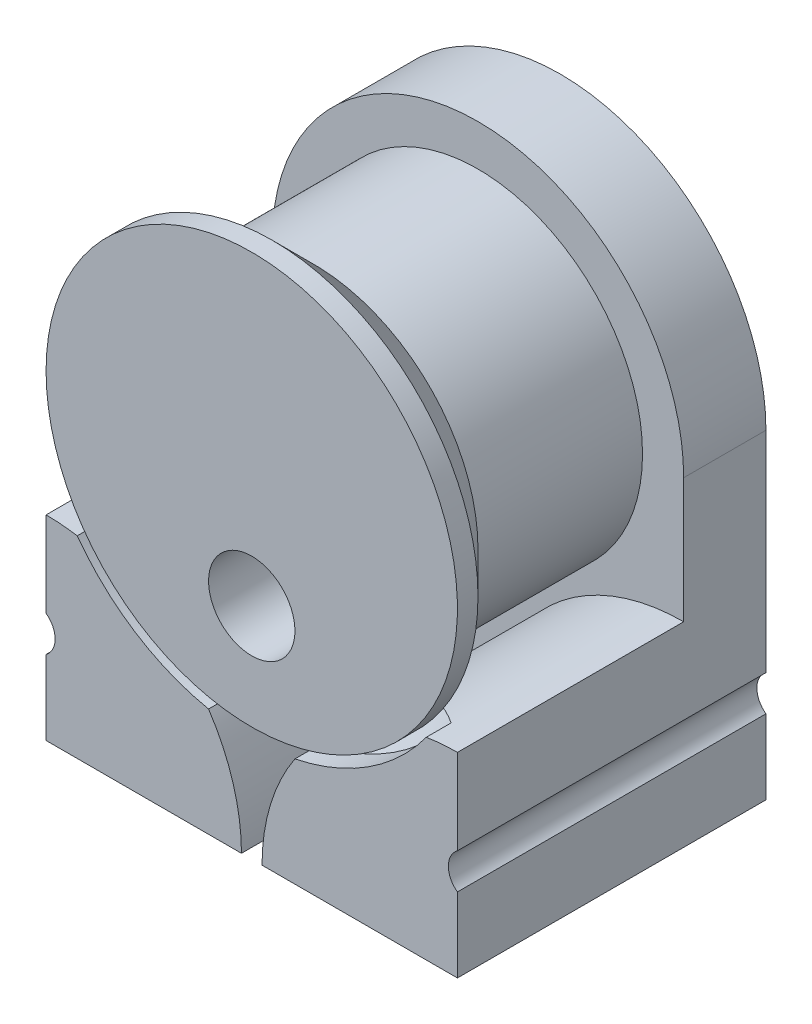
ISO-10303-21;
HEADER;
FILE_DESCRIPTION(('STEP AP214'),'2;1');
FILE_NAME('part.step','',(''),(''),'','','');
FILE_SCHEMA(('AUTOMOTIVE_DESIGN { 1 0 10303 214 1 1 1 1 }'));
ENDSEC;
DATA;
#1=APPLICATION_CONTEXT('core data for automotive mechanical design processes');
#2=APPLICATION_PROTOCOL_DEFINITION('international standard','automotive_design',2000,#1);
#3=PRODUCT_CONTEXT('',#1,'mechanical');
#4=PRODUCT('Part','Part','',(#3));
#5=PRODUCT_RELATED_PRODUCT_CATEGORY('part','',(#4));
#6=PRODUCT_DEFINITION_FORMATION('','',#4);
#7=PRODUCT_DEFINITION_CONTEXT('part definition',#1,'design');
#8=PRODUCT_DEFINITION('design','',#6,#7);
#9=PRODUCT_DEFINITION_SHAPE('','',#8);
#10=(LENGTH_UNIT() NAMED_UNIT(*) SI_UNIT(.MILLI.,.METRE.));
#11=(NAMED_UNIT(*) PLANE_ANGLE_UNIT() SI_UNIT($,.RADIAN.));
#12=(NAMED_UNIT(*) SI_UNIT($,.STERADIAN.) SOLID_ANGLE_UNIT());
#13=UNCERTAINTY_MEASURE_WITH_UNIT(LENGTH_MEASURE(1.E-05),#10,'distance_accuracy_value','');
#14=(GEOMETRIC_REPRESENTATION_CONTEXT(3) GLOBAL_UNCERTAINTY_ASSIGNED_CONTEXT((#13)) GLOBAL_UNIT_ASSIGNED_CONTEXT((#10,
#11,#12)) REPRESENTATION_CONTEXT('',''));
#15=CARTESIAN_POINT('',(0.,0.,0.));
#16=DIRECTION('',(0.,0.,1.));
#17=DIRECTION('',(1.,0.,0.));
#18=AXIS2_PLACEMENT_3D('',#15,#16,#17);
#19=CARTESIAN_POINT('',(-2.85327317332453E-13,435.100000000001,344.000000000001));
#20=DIRECTION('',(0.,0.,-1.));
#21=DIRECTION('',(-1.,0.,0.));
#22=AXIS2_PLACEMENT_3D('',#19,#20,#21);
#23=CYLINDRICAL_SURFACE('',#22,2.10000000000003);
#24=CARTESIAN_POINT('',(-2.85327317332453E-13,435.100000000001,327.950000000001));
#25=DIRECTION('',(0.,0.,-1.));
#26=DIRECTION('',(-1.,0.,0.));
#27=AXIS2_PLACEMENT_3D('',#24,#25,#26);
#28=CIRCLE('',#27,2.10000000000003);
#29=CARTESIAN_POINT('',(-2.10000000000031,435.100000000001,327.950000000001));
#30=VERTEX_POINT('',#29);
#31=EDGE_CURVE('E19',#30,#30,#28,.F.);
#32=ORIENTED_EDGE('',*,*,#31,.F.);
#33=EDGE_LOOP('',(#32));
#34=FACE_BOUND('',#33,.T.);
#35=CARTESIAN_POINT('',(-2.85327317332453E-13,435.100000000001,344.000000000001));
#36=DIRECTION('',(0.,0.,-1.));
#37=DIRECTION('',(-1.,0.,0.));
#38=AXIS2_PLACEMENT_3D('',#35,#36,#37);
#39=CIRCLE('',#38,2.10000000000003);
#40=CARTESIAN_POINT('',(-2.10000000000031,435.100000000001,344.000000000001));
#41=VERTEX_POINT('',#40);
#42=EDGE_CURVE('E407',#41,#41,#39,.T.);
#43=ORIENTED_EDGE('',*,*,#42,.F.);
#44=EDGE_LOOP('',(#43));
#45=FACE_BOUND('',#44,.T.);
#46=ADVANCED_FACE('F16',(#34,#45),#23,.F.);
#47=CARTESIAN_POINT('',(-2.85327317332453E-13,440.000000000001,344.000000000001));
#48=DIRECTION('',(0.,0.,-1.));
#49=DIRECTION('',(-1.,0.,0.));
#50=AXIS2_PLACEMENT_3D('',#47,#48,#49);
#51=CYLINDRICAL_SURFACE('',#50,10.5);
#52=CARTESIAN_POINT('',(-2.85327317332453E-13,440.000000000001,344.000000000001));
#53=DIRECTION('',(0.,0.,-1.));
#54=DIRECTION('',(-1.,0.,0.));
#55=AXIS2_PLACEMENT_3D('',#52,#53,#54);
#56=CIRCLE('',#55,10.5);
#57=CARTESIAN_POINT('',(8.48424199356027,433.81391579473,344.000000000001));
#58=VERTEX_POINT('',#57);
#59=CARTESIAN_POINT('',(2.10012615747792,429.712168832905,344.000000000001));
#60=VERTEX_POINT('',#59);
#61=EDGE_CURVE('E393',#58,#60,#56,.T.);
#62=ORIENTED_EDGE('',*,*,#61,.F.);
#63=DIRECTION('',(0.,0.,-1.));
#64=VECTOR('',#63,1.);
#65=CARTESIAN_POINT('',(8.48424199356025,433.81391579473,344.000000000001));
#66=LINE('',#65,#64);
#67=CARTESIAN_POINT('',(8.48424199356004,433.81391579473,342.792893218815));
#68=VERTEX_POINT('',#67);
#69=EDGE_CURVE('E448',#68,#58,#66,.F.);
#70=ORIENTED_EDGE('',*,*,#69,.F.);
#71=CARTESIAN_POINT('',(-2.85327317332453E-13,440.000000000001,342.792893218814));
#72=DIRECTION('',(0.,0.,1.));
#73=DIRECTION('',(-1.,0.,0.));
#74=AXIS2_PLACEMENT_3D('',#71,#72,#73);
#75=CIRCLE('',#74,10.4999999999997);
#76=CARTESIAN_POINT('',(2.10012615747805,429.712168832905,342.792893218815));
#77=VERTEX_POINT('',#76);
#78=EDGE_CURVE('E404',#68,#77,#75,.F.);
#79=ORIENTED_EDGE('',*,*,#78,.T.);
#80=DIRECTION('',(0.,0.,-1.));
#81=VECTOR('',#80,1.);
#82=CARTESIAN_POINT('',(2.10012615747795,429.712168832905,344.000000000001));
#83=LINE('',#82,#81);
#84=EDGE_CURVE('E163',#60,#77,#83,.T.);
#85=ORIENTED_EDGE('',*,*,#84,.F.);
#86=EDGE_LOOP('',(#62,#70,#79,#85));
#87=FACE_BOUND('',#86,.T.);
#88=ADVANCED_FACE('F298',(#87),#51,.F.);
#89=CARTESIAN_POINT('',(-2.73644660940691,424.435617565764,327.950000000001));
#90=DIRECTION('',(-0.707106781186555,0.,-0.70710678118654));
#91=DIRECTION('',(-0.70710678118654,0.,0.707106781186555));
#92=AXIS2_PLACEMENT_3D('',#89,#90,#91);
#93=PLANE('',#92);
#94=DIRECTION('',(-0.707106781186576,0.,0.707106781186519));
#95=VECTOR('',#94,1.);
#96=CARTESIAN_POINT('',(-2.73644660940691,439.999617565764,327.950000000001));
#97=LINE('',#96,#95);
#98=CARTESIAN_POINT('',(-2.73644660940691,439.999617565764,327.950000000001));
#99=VERTEX_POINT('',#98);
#100=CARTESIAN_POINT('',(-3.78644660940699,439.999617565764,329.000000000001));
#101=VERTEX_POINT('',#100);
#102=EDGE_CURVE('E162',#99,#101,#97,.T.);
#103=ORIENTED_EDGE('',*,*,#102,.F.);
#104=DIRECTION('',(0.,1.,0.));
#105=VECTOR('',#104,1.);
#106=CARTESIAN_POINT('',(-2.73644660940691,424.435617565764,327.950000000001));
#107=LINE('',#106,#105);
#108=CARTESIAN_POINT('',(-2.73644660940691,424.435617565759,327.950000000001));
#109=VERTEX_POINT('',#108);
#110=EDGE_CURVE('E166',#109,#99,#107,.T.);
#111=ORIENTED_EDGE('',*,*,#110,.F.);
#112=DIRECTION('',(-0.70710678118654,0.,0.707106781186555));
#113=VECTOR('',#112,1.);
#114=CARTESIAN_POINT('',(-2.73644660940691,424.435617565764,327.950000000001));
#115=LINE('',#114,#113);
#116=CARTESIAN_POINT('',(-3.78644660940697,424.435617565746,329.000000000001));
#117=VERTEX_POINT('',#116);
#118=EDGE_CURVE('E152',#109,#117,#115,.T.);
#119=ORIENTED_EDGE('',*,*,#118,.T.);
#120=DIRECTION('',(0.,-1.,0.));
#121=VECTOR('',#120,1.);
#122=CARTESIAN_POINT('',(-3.78644660940699,437.217808782779,329.000000000001));
#123=LINE('',#122,#121);
#124=EDGE_CURVE('E378',#117,#101,#123,.F.);
#125=ORIENTED_EDGE('',*,*,#124,.T.);
#126=EDGE_LOOP('',(#103,#111,#119,#125));
#127=FACE_BOUND('',#126,.T.);
#128=ADVANCED_FACE('F167',(#127),#93,.T.);
#129=CARTESIAN_POINT('',(-1.34336985979644E-13,439.999617565764,328.475000000001));
#130=DIRECTION('',(0.,1.,0.));
#131=DIRECTION('',(0.,0.,1.));
#132=AXIS2_PLACEMENT_3D('',#129,#130,#131);
#133=PLANE('',#132);
#134=DIRECTION('',(1.,0.,0.));
#135=VECTOR('',#134,1.);
#136=CARTESIAN_POINT('',(-2.79776202122451E-13,439.999617565764,329.000000000001));
#137=LINE('',#136,#135);
#138=CARTESIAN_POINT('',(3.78644660940672,439.999617565764,329.000000000001));
#139=VERTEX_POINT('',#138);
#140=EDGE_CURVE('E416',#101,#139,#137,.T.);
#141=ORIENTED_EDGE('',*,*,#140,.T.);
#142=DIRECTION('',(-0.707106781186542,0.,-0.707106781186553));
#143=VECTOR('',#142,1.);
#144=CARTESIAN_POINT('',(3.78644660940673,439.999617565764,329.000000000001));
#145=LINE('',#144,#143);
#146=CARTESIAN_POINT('',(2.73644660940664,439.999617565764,327.950000000001));
#147=VERTEX_POINT('',#146);
#148=EDGE_CURVE('E129',#147,#139,#145,.F.);
#149=ORIENTED_EDGE('',*,*,#148,.F.);
#150=DIRECTION('',(-1.,0.,0.));
#151=VECTOR('',#150,1.);
#152=CARTESIAN_POINT('',(2.73644660940656,439.999617565764,327.950000000001));
#153=LINE('',#152,#151);
#154=EDGE_CURVE('E171',#99,#147,#153,.F.);
#155=ORIENTED_EDGE('',*,*,#154,.F.);
#156=ORIENTED_EDGE('',*,*,#102,.T.);
#157=EDGE_LOOP('',(#141,#149,#155,#156));
#158=FACE_BOUND('',#157,.T.);
#159=ADVANCED_FACE('F293',(#158),#133,.T.);
#160=CARTESIAN_POINT('',(3.78644660940673,424.435617565764,329.000000000001));
#161=DIRECTION('',(0.707106781186553,0.,-0.707106781186542));
#162=DIRECTION('',(-0.707106781186542,0.,-0.707106781186553));
#163=AXIS2_PLACEMENT_3D('',#160,#161,#162);
#164=PLANE('',#163);
#165=ORIENTED_EDGE('',*,*,#148,.T.);
#166=DIRECTION('',(0.,-1.,0.));
#167=VECTOR('',#166,1.);
#168=CARTESIAN_POINT('',(3.78644660940672,437.217808782779,329.000000000001));
#169=LINE('',#168,#167);
#170=CARTESIAN_POINT('',(3.78644660940673,424.435617565779,329.000000000001));
#171=VERTEX_POINT('',#170);
#172=EDGE_CURVE('E372',#139,#171,#169,.T.);
#173=ORIENTED_EDGE('',*,*,#172,.T.);
#174=DIRECTION('',(-0.707106781186542,0.,-0.707106781186553));
#175=VECTOR('',#174,1.);
#176=CARTESIAN_POINT('',(3.78644660940673,424.435617565764,329.000000000001));
#177=LINE('',#176,#175);
#178=CARTESIAN_POINT('',(2.7364466094066,424.435617565766,327.950000000001));
#179=VERTEX_POINT('',#178);
#180=EDGE_CURVE('E428',#171,#179,#177,.T.);
#181=ORIENTED_EDGE('',*,*,#180,.T.);
#182=DIRECTION('',(0.,1.,0.));
#183=VECTOR('',#182,1.);
#184=CARTESIAN_POINT('',(2.73644660940656,424.435617565764,327.950000000001));
#185=LINE('',#184,#183);
#186=EDGE_CURVE('E176',#147,#179,#185,.F.);
#187=ORIENTED_EDGE('',*,*,#186,.F.);
#188=EDGE_LOOP('',(#165,#173,#181,#187));
#189=FACE_BOUND('',#188,.T.);
#190=ADVANCED_FACE('F289',(#189),#164,.T.);
#191=CARTESIAN_POINT('',(-2.85327317332453E-13,440.000000000001,344.000000000001));
#192=DIRECTION('',(0.,0.,-1.));
#193=DIRECTION('',(-1.,0.,0.));
#194=AXIS2_PLACEMENT_3D('',#191,#192,#193);
#195=CYLINDRICAL_SURFACE('',#194,10.5);
#196=CARTESIAN_POINT('',(-2.85327317332453E-13,440.000000000001,344.000000000001));
#197=DIRECTION('',(0.,0.,-1.));
#198=DIRECTION('',(-1.,0.,0.));
#199=AXIS2_PLACEMENT_3D('',#196,#197,#198);
#200=CIRCLE('',#199,10.5);
#201=CARTESIAN_POINT('',(-2.10012615450036,429.712168832297,344.000000000001));
#202=VERTEX_POINT('',#201);
#203=CARTESIAN_POINT('',(-8.48424199520149,433.81391579698,344.000000000001));
#204=VERTEX_POINT('',#203);
#205=EDGE_CURVE('E362',#202,#204,#200,.T.);
#206=ORIENTED_EDGE('',*,*,#205,.F.);
#207=DIRECTION('',(0.,0.,-1.));
#208=VECTOR('',#207,1.);
#209=CARTESIAN_POINT('',(-2.10012615450045,429.712168832297,344.000000000001));
#210=LINE('',#209,#208);
#211=CARTESIAN_POINT('',(-2.10012615450051,429.712168832297,342.792893218815));
#212=VERTEX_POINT('',#211);
#213=EDGE_CURVE('E422',#212,#202,#210,.F.);
#214=ORIENTED_EDGE('',*,*,#213,.F.);
#215=CARTESIAN_POINT('',(-2.85327317332453E-13,440.000000000001,342.792893218814));
#216=DIRECTION('',(0.,0.,1.));
#217=DIRECTION('',(-1.,0.,0.));
#218=AXIS2_PLACEMENT_3D('',#215,#216,#217);
#219=CIRCLE('',#218,10.4999999999996);
#220=CARTESIAN_POINT('',(-8.48424199520122,433.81391579698,342.792893218815));
#221=VERTEX_POINT('',#220);
#222=EDGE_CURVE('E366',#212,#221,#219,.F.);
#223=ORIENTED_EDGE('',*,*,#222,.T.);
#224=DIRECTION('',(0.,0.,-1.));
#225=VECTOR('',#224,1.);
#226=CARTESIAN_POINT('',(-8.48424199520137,433.81391579698,344.000000000001));
#227=LINE('',#226,#225);
#228=EDGE_CURVE('E172',#204,#221,#227,.T.);
#229=ORIENTED_EDGE('',*,*,#228,.F.);
#230=EDGE_LOOP('',(#206,#214,#223,#229));
#231=FACE_BOUND('',#230,.T.);
#232=ADVANCED_FACE('F285',(#231),#195,.F.);
#233=CARTESIAN_POINT('',(-10.0000000000003,440.000000000001,329.000000000001));
#234=DIRECTION('',(-1.,0.,0.));
#235=DIRECTION('',(0.,-1.,0.));
#236=AXIS2_PLACEMENT_3D('',#233,#234,#235);
#237=PLANE('',#236);
#238=DIRECTION('',(0.,0.,1.));
#239=VECTOR('',#238,1.);
#240=CARTESIAN_POINT('',(-10.0000000000003,424.435617565712,329.000000000001));
#241=LINE('',#240,#239);
#242=CARTESIAN_POINT('',(-10.0000000000003,424.435617565712,344.000000000001));
#243=VERTEX_POINT('',#242);
#244=CARTESIAN_POINT('',(-10.0000000000003,424.435617565712,329.000000000001));
#245=VERTEX_POINT('',#244);
#246=EDGE_CURVE('E182',#243,#245,#241,.F.);
#247=ORIENTED_EDGE('',*,*,#246,.F.);
#248=DIRECTION('',(0.,-1.,0.));
#249=VECTOR('',#248,1.);
#250=CARTESIAN_POINT('',(-10.0000000000003,429.185617566863,344.000000000001));
#251=LINE('',#250,#249);
#252=CARTESIAN_POINT('',(-10.0000000000005,428.06020241429,344.000000000001));
#253=VERTEX_POINT('',#252);
#254=EDGE_CURVE('E359',#253,#243,#251,.T.);
#255=ORIENTED_EDGE('',*,*,#254,.F.);
#256=DIRECTION('',(0.,0.,-1.));
#257=VECTOR('',#256,1.);
#258=CARTESIAN_POINT('',(-10.0000000000007,428.06020241429,344.000000000001));
#259=LINE('',#258,#257);
#260=CARTESIAN_POINT('',(-10.0000000000005,428.06020241429,329.000000000001));
#261=VERTEX_POINT('',#260);
#262=EDGE_CURVE('E392',#253,#261,#259,.T.);
#263=ORIENTED_EDGE('',*,*,#262,.T.);
#264=DIRECTION('',(0.,-1.,0.));
#265=VECTOR('',#264,1.);
#266=CARTESIAN_POINT('',(-10.0000000000003,437.217808782779,329.000000000001));
#267=LINE('',#266,#265);
#268=EDGE_CURVE('E375',#261,#245,#267,.T.);
#269=ORIENTED_EDGE('',*,*,#268,.T.);
#270=EDGE_LOOP('',(#247,#255,#263,#269));
#271=FACE_BOUND('',#270,.T.);
#272=ADVANCED_FACE('F281',(#271),#237,.T.);
#273=CARTESIAN_POINT('',(2.73644660940656,424.435617565764,327.950000000001));
#274=DIRECTION('',(0.,0.,-1.));
#275=DIRECTION('',(-1.,0.,0.));
#276=AXIS2_PLACEMENT_3D('',#273,#274,#275);
#277=PLANE('',#276);
#278=ORIENTED_EDGE('',*,*,#31,.T.);
#279=EDGE_LOOP('',(#278));
#280=FACE_BOUND('',#279,.T.);
#281=ORIENTED_EDGE('',*,*,#154,.T.);
#282=ORIENTED_EDGE('',*,*,#186,.T.);
#283=DIRECTION('',(1.,5.43565192856476E-12,0.));
#284=VECTOR('',#283,1.);
#285=CARTESIAN_POINT('',(-10.0000000000003,424.435617565712,327.950000000001));
#286=LINE('',#285,#284);
#287=EDGE_CURVE('E156',#109,#179,#286,.T.);
#288=ORIENTED_EDGE('',*,*,#287,.F.);
#289=ORIENTED_EDGE('',*,*,#110,.T.);
#290=EDGE_LOOP('',(#281,#282,#288,#289));
#291=FACE_BOUND('',#290,.T.);
#292=ADVANCED_FACE('F175',(#280,#291),#277,.T.);
#293=CARTESIAN_POINT('',(9.99999999999972,424.435617565556,329.000000000001));
#294=DIRECTION('',(1.,0.,0.));
#295=DIRECTION('',(0.,1.,0.));
#296=AXIS2_PLACEMENT_3D('',#293,#294,#295);
#297=PLANE('',#296);
#298=DIRECTION('',(0.,0.,1.));
#299=VECTOR('',#298,1.);
#300=CARTESIAN_POINT('',(9.99999999999972,424.435617565821,329.000000000001));
#301=LINE('',#300,#299);
#302=CARTESIAN_POINT('',(9.99999999999972,424.435617565802,329.000000000001));
#303=VERTEX_POINT('',#302);
#304=CARTESIAN_POINT('',(9.99999999999972,424.435617565737,344.000000000001));
#305=VERTEX_POINT('',#304);
#306=EDGE_CURVE('E180',#303,#305,#301,.T.);
#307=ORIENTED_EDGE('',*,*,#306,.F.);
#308=DIRECTION('',(0.,-1.,0.));
#309=VECTOR('',#308,1.);
#310=CARTESIAN_POINT('',(9.99999999999972,437.217808782779,329.000000000001));
#311=LINE('',#310,#309);
#312=CARTESIAN_POINT('',(9.99999999999991,428.06020241429,329.000000000001));
#313=VERTEX_POINT('',#312);
#314=EDGE_CURVE('E370',#303,#313,#311,.F.);
#315=ORIENTED_EDGE('',*,*,#314,.T.);
#316=DIRECTION('',(0.,0.,-1.));
#317=VECTOR('',#316,1.);
#318=CARTESIAN_POINT('',(10.0000000000001,428.06020241429,344.000000000001));
#319=LINE('',#318,#317);
#320=CARTESIAN_POINT('',(9.99999999999991,428.06020241429,344.000000000001));
#321=VERTEX_POINT('',#320);
#322=EDGE_CURVE('E120',#313,#321,#319,.F.);
#323=ORIENTED_EDGE('',*,*,#322,.T.);
#324=DIRECTION('',(0.,-1.,0.));
#325=VECTOR('',#324,1.);
#326=CARTESIAN_POINT('',(9.99999999999972,429.185617565807,344.000000000001));
#327=LINE('',#326,#325);
#328=EDGE_CURVE('E389',#305,#321,#327,.F.);
#329=ORIENTED_EDGE('',*,*,#328,.F.);
#330=EDGE_LOOP('',(#307,#315,#323,#329));
#331=FACE_BOUND('',#330,.T.);
#332=ADVANCED_FACE('F275',(#331),#297,.T.);
#333=CARTESIAN_POINT('',(-2.84772205816353E-13,440.000000000001,344.000000000001));
#334=DIRECTION('',(0.,0.,1.));
#335=DIRECTION('',(1.,0.,0.));
#336=AXIS2_PLACEMENT_3D('',#333,#334,#335);
#337=PLANE('',#336);
#338=ORIENTED_EDGE('',*,*,#42,.T.);
#339=EDGE_LOOP('',(#338));
#340=FACE_BOUND('',#339,.T.);
#341=CARTESIAN_POINT('',(-2.85327317332453E-13,440.000000000001,344.000000000001));
#342=DIRECTION('',(0.,0.,-1.));
#343=DIRECTION('',(-1.,0.,0.));
#344=AXIS2_PLACEMENT_3D('',#341,#342,#343);
#345=CIRCLE('',#344,10.);
#346=CARTESIAN_POINT('',(-10.0000000000003,440.000000000001,344.000000000001));
#347=VERTEX_POINT('',#346);
#348=EDGE_CURVE('E262',#347,#347,#345,.T.);
#349=ORIENTED_EDGE('',*,*,#348,.F.);
#350=EDGE_LOOP('',(#349));
#351=FACE_BOUND('',#350,.T.);
#352=ADVANCED_FACE('F270',(#340,#351),#337,.T.);
#353=CARTESIAN_POINT('',(-2.85362011798185E-13,440.000000000001,342.792893218814));
#354=DIRECTION('',(0.,0.,1.));
#355=DIRECTION('',(1.,0.,0.));
#356=AXIS2_PLACEMENT_3D('',#353,#354,#355);
#357=CONICAL_SURFACE('',#356,10.4999999999997,0.785398163397438);
#358=ORIENTED_EDGE('',*,*,#78,.F.);
#359=CARTESIAN_POINT('',(2.10012615747811,429.712168832905,342.792893218814));
#360=CARTESIAN_POINT('',(2.18479779041489,429.838895311102,342.68571191633));
#361=CARTESIAN_POINT('',(2.27361513965295,429.96530333963,342.581252486632));
#362=CARTESIAN_POINT('',(2.46052099960255,430.217580722435,342.379276338492));
#363=CARTESIAN_POINT('',(2.55863556737761,430.343447463415,342.281780561438));
#364=CARTESIAN_POINT('',(2.76638243779769,430.596130933452,342.094293554601));
#365=CARTESIAN_POINT('',(2.87618195283214,430.722927531902,342.004457769162));
#366=CARTESIAN_POINT('',(3.10638952233652,430.974518945584,341.836837672188));
#367=CARTESIAN_POINT('',(3.22678520474039,431.099315899434,341.759039590783));
#368=CARTESIAN_POINT('',(3.52390535415852,431.390275782936,341.593287132563));
#369=CARTESIAN_POINT('',(3.7054163954792,431.5553358036,341.511589245267));
#370=CARTESIAN_POINT('',(3.99183063508738,431.795466810184,341.416192990436));
#371=CARTESIAN_POINT('',(4.08939145255492,431.87407490544,341.388954778059));
#372=CARTESIAN_POINT('',(4.28894266930965,432.028357193194,341.344232987635));
#373=CARTESIAN_POINT('',(4.3909309455882,432.104032759629,341.326744788854));
#374=CARTESIAN_POINT('',(4.5996492544149,432.252442992006,341.302056417024));
#375=CARTESIAN_POINT('',(4.7064137635243,432.325144968501,341.294950478431));
#376=CARTESIAN_POINT('',(4.9229457831797,432.466197468147,341.29160900257));
#377=CARTESIAN_POINT('',(5.03271324676092,432.534548059296,341.295373295393));
#378=CARTESIAN_POINT('',(5.25443485748701,432.666430123141,341.313633243862));
#379=CARTESIAN_POINT('',(5.36639188223167,432.729954631322,341.328144095263));
#380=CARTESIAN_POINT('',(5.59143566313277,432.851729845857,341.367358160429));
#381=CARTESIAN_POINT('',(5.70452298403262,432.909977752801,341.392066746254));
#382=CARTESIAN_POINT('',(5.9520528958104,433.031343042608,341.456296210421));
#383=CARTESIAN_POINT('',(6.08654790129299,433.093345089836,341.497719330097));
#384=CARTESIAN_POINT('',(6.35489685062882,433.20970700446,341.592010724826));
#385=CARTESIAN_POINT('',(6.48875023730398,433.264061098661,341.644887570281));
#386=CARTESIAN_POINT('',(6.75546826527494,433.365535911485,341.760489713619));
#387=CARTESIAN_POINT('',(6.88832837101487,433.412632922974,341.82324598979));
#388=CARTESIAN_POINT('',(7.15219366077263,433.499794585111,341.956831595262));
#389=CARTESIAN_POINT('',(7.28319925713663,433.539860822354,342.027659097209));
#390=CARTESIAN_POINT('',(7.59653510701797,433.628531298045,342.20639655167));
#391=CARTESIAN_POINT('',(7.77790076755833,433.673907198503,342.317609570718));
#392=CARTESIAN_POINT('',(8.04603417999555,433.732944327343,342.491408813547));
#393=CARTESIAN_POINT('',(8.13435163873345,433.751054340627,342.55021143257));
#394=CARTESIAN_POINT('',(8.31001238632952,433.784517179878,342.66999008042));
#395=CARTESIAN_POINT('',(8.39735581639186,433.799870410497,342.730965788693));
#396=CARTESIAN_POINT('',(8.48424199355994,433.81391579473,342.792893218814));
#397=B_SPLINE_CURVE_WITH_KNOTS('',3,(#359,#360,#361,#362,#363,#364,#365,#366,#367,#368,#369,
#370,#371,#372,#373,#374,#375,#376,#377,#378,#379,#380,#381,#382,#383,#384,#385,#386,#387,#388,
#389,#390,#391,#392,#393,#394,#395,#396),.UNSPECIFIED.,.F.,.F.,(4,2,2,2,2,2,2,2,2,2,2,2,2,2,2,2,
2,2,4),(0.,0.559054345413364,1.11972469099276,1.68991040327212,2.25943898268726,
3.03187468724661,3.41612386072894,3.80019077542571,4.18772246694005,4.57524810110329,
4.96332274960025,5.35160209321614,5.81223791210797,6.27321960592904,6.73567666897444,
7.19802923737979,7.84982811752394,8.1726934452781,8.49551134259726),.UNSPECIFIED.);
#398=EDGE_CURVE('E252',#77,#68,#397,.T.);
#399=ORIENTED_EDGE('',*,*,#398,.F.);
#400=EDGE_LOOP('',(#358,#399));
#401=FACE_BOUND('',#400,.T.);
#402=ADVANCED_FACE('F264',(#401),#357,.F.);
#403=CARTESIAN_POINT('',(10.6298158491508,428.925799984371,344.000000000001));
#404=DIRECTION('',(0.,0.,-1.));
#405=DIRECTION('',(-1.,0.,0.));
#406=AXIS2_PLACEMENT_3D('',#403,#404,#405);
#407=CYLINDRICAL_SURFACE('',#406,1.07047987238082);
#408=ORIENTED_EDGE('',*,*,#322,.F.);
#409=CARTESIAN_POINT('',(10.6298158491508,428.925799984371,329.000000000001));
#410=DIRECTION('',(0.,0.,-1.));
#411=DIRECTION('',(-1.,0.,0.));
#412=AXIS2_PLACEMENT_3D('',#409,#410,#411);
#413=CIRCLE('',#412,1.07047987238082);
#414=CARTESIAN_POINT('',(9.99999999999972,429.791397554452,329.000000000001));
#415=VERTEX_POINT('',#414);
#416=EDGE_CURVE('E369',#313,#415,#413,.T.);
#417=ORIENTED_EDGE('',*,*,#416,.T.);
#418=DIRECTION('',(0.,0.,1.));
#419=VECTOR('',#418,1.);
#420=CARTESIAN_POINT('',(9.99999999999972,429.791397554452,329.000000000001));
#421=LINE('',#420,#419);
#422=CARTESIAN_POINT('',(9.99999999999972,429.791397554452,344.000000000001));
#423=VERTEX_POINT('',#422);
#424=EDGE_CURVE('E388',#423,#415,#421,.F.);
#425=ORIENTED_EDGE('',*,*,#424,.F.);
#426=CARTESIAN_POINT('',(10.6298158491508,428.925799984371,344.000000000001));
#427=DIRECTION('',(0.,0.,-1.));
#428=DIRECTION('',(-1.,0.,0.));
#429=AXIS2_PLACEMENT_3D('',#426,#427,#428);
#430=CIRCLE('',#429,1.07047987238082);
#431=EDGE_CURVE('E427',#321,#423,#430,.T.);
#432=ORIENTED_EDGE('',*,*,#431,.F.);
#433=EDGE_LOOP('',(#408,#417,#425,#432));
#434=FACE_BOUND('',#433,.T.);
#435=ADVANCED_FACE('F269',(#434),#407,.F.);
#436=CARTESIAN_POINT('',(5.2500000000359,429.185617565807,344.000000000001));
#437=DIRECTION('',(0.,0.,1.));
#438=DIRECTION('',(0.,-1.,0.));
#439=AXIS2_PLACEMENT_3D('',#436,#437,#438);
#440=PLANE('',#439);
#441=DIRECTION('',(1.,5.43565192856476E-12,0.));
#442=VECTOR('',#441,1.);
#443=CARTESIAN_POINT('',(-10.0000000000003,424.435617565712,344.000000000001));
#444=LINE('',#443,#442);
#445=CARTESIAN_POINT('',(0.500000000072078,424.43561756567,344.000000000001));
#446=VERTEX_POINT('',#445);
#447=EDGE_CURVE('E400',#305,#446,#444,.F.);
#448=ORIENTED_EDGE('',*,*,#447,.F.);
#449=ORIENTED_EDGE('',*,*,#328,.T.);
#450=ORIENTED_EDGE('',*,*,#431,.T.);
#451=DIRECTION('',(0.,1.,0.));
#452=VECTOR('',#451,1.);
#453=CARTESIAN_POINT('',(9.99999999999972,424.435617565556,344.000000000001));
#454=LINE('',#453,#452);
#455=CARTESIAN_POINT('',(9.99999999999971,433.935617566058,344.000000000001));
#456=VERTEX_POINT('',#455);
#457=EDGE_CURVE('E342',#456,#423,#454,.F.);
#458=ORIENTED_EDGE('',*,*,#457,.F.);
#459=CARTESIAN_POINT('',(9.9999999999953,424.435617566135,344.000000000001));
#460=DIRECTION('',(0.,0.,1.));
#461=DIRECTION('',(1.,0.,0.));
#462=AXIS2_PLACEMENT_3D('',#459,#460,#461);
#463=CIRCLE('',#462,9.49999999992322);
#464=EDGE_CURVE('E261',#58,#456,#463,.F.);
#465=ORIENTED_EDGE('',*,*,#464,.F.);
#466=ORIENTED_EDGE('',*,*,#61,.T.);
#467=CARTESIAN_POINT('',(9.9999999999953,424.435617566135,344.000000000001));
#468=DIRECTION('',(0.,0.,1.));
#469=DIRECTION('',(1.,0.,0.));
#470=AXIS2_PLACEMENT_3D('',#467,#468,#469);
#471=CIRCLE('',#470,9.49999999992322);
#472=EDGE_CURVE('E347',#446,#60,#471,.F.);
#473=ORIENTED_EDGE('',*,*,#472,.F.);
#474=EDGE_LOOP('',(#448,#449,#450,#458,#465,#466,#473));
#475=FACE_BOUND('',#474,.T.);
#476=ADVANCED_FACE('F585',(#475),#440,.T.);
#477=CARTESIAN_POINT('',(-10.6298158491514,428.925799984371,344.000000000001));
#478=DIRECTION('',(0.,0.,-1.));
#479=DIRECTION('',(-1.,0.,0.));
#480=AXIS2_PLACEMENT_3D('',#477,#478,#479);
#481=CYLINDRICAL_SURFACE('',#480,1.07047987238082);
#482=DIRECTION('',(0.,0.,1.));
#483=VECTOR('',#482,1.);
#484=CARTESIAN_POINT('',(-10.0000000000003,429.791397554452,329.000000000001));
#485=LINE('',#484,#483);
#486=CARTESIAN_POINT('',(-10.0000000000003,429.791397554452,329.000000000001));
#487=VERTEX_POINT('',#486);
#488=CARTESIAN_POINT('',(-10.0000000000003,429.791397554452,344.000000000001));
#489=VERTEX_POINT('',#488);
#490=EDGE_CURVE('E338',#487,#489,#485,.T.);
#491=ORIENTED_EDGE('',*,*,#490,.F.);
#492=CARTESIAN_POINT('',(-10.6298158491514,428.925799984371,329.000000000001));
#493=DIRECTION('',(0.,0.,-1.));
#494=DIRECTION('',(-1.,0.,0.));
#495=AXIS2_PLACEMENT_3D('',#492,#493,#494);
#496=CIRCLE('',#495,1.07047987238082);
#497=EDGE_CURVE('E379',#487,#261,#496,.T.);
#498=ORIENTED_EDGE('',*,*,#497,.T.);
#499=ORIENTED_EDGE('',*,*,#262,.F.);
#500=CARTESIAN_POINT('',(-10.6298158491514,428.925799984371,344.000000000001));
#501=DIRECTION('',(0.,0.,-1.));
#502=DIRECTION('',(-1.,0.,0.));
#503=AXIS2_PLACEMENT_3D('',#500,#501,#502);
#504=CIRCLE('',#503,1.07047987238082);
#505=EDGE_CURVE('E363',#489,#253,#504,.T.);
#506=ORIENTED_EDGE('',*,*,#505,.F.);
#507=EDGE_LOOP('',(#491,#498,#499,#506));
#508=FACE_BOUND('',#507,.T.);
#509=ADVANCED_FACE('F578',(#508),#481,.F.);
#510=CARTESIAN_POINT('',(-2.79776202122451E-13,437.217808782779,329.000000000001));
#511=DIRECTION('',(0.,0.,1.));
#512=DIRECTION('',(0.,-1.,0.));
#513=AXIS2_PLACEMENT_3D('',#510,#511,#512);
#514=PLANE('',#513);
#515=ORIENTED_EDGE('',*,*,#314,.F.);
#516=DIRECTION('',(1.,5.43565192856476E-12,0.));
#517=VECTOR('',#516,1.);
#518=CARTESIAN_POINT('',(-10.0000000000003,424.435617565712,329.000000000001));
#519=LINE('',#518,#517);
#520=EDGE_CURVE('E177',#171,#303,#519,.T.);
#521=ORIENTED_EDGE('',*,*,#520,.F.);
#522=ORIENTED_EDGE('',*,*,#172,.F.);
#523=ORIENTED_EDGE('',*,*,#140,.F.);
#524=ORIENTED_EDGE('',*,*,#124,.F.);
#525=DIRECTION('',(1.,5.43565192856476E-12,0.));
#526=VECTOR('',#525,1.);
#527=CARTESIAN_POINT('',(-10.0000000000003,424.435617565712,329.000000000001));
#528=LINE('',#527,#526);
#529=EDGE_CURVE('E159',#245,#117,#528,.T.);
#530=ORIENTED_EDGE('',*,*,#529,.F.);
#531=ORIENTED_EDGE('',*,*,#268,.F.);
#532=ORIENTED_EDGE('',*,*,#497,.F.);
#533=DIRECTION('',(0.,-1.,0.));
#534=VECTOR('',#533,1.);
#535=CARTESIAN_POINT('',(-10.0000000000003,440.000000000001,329.000000000001));
#536=LINE('',#535,#534);
#537=CARTESIAN_POINT('',(-10.0000000000003,440.000000000001,329.000000000001));
#538=VERTEX_POINT('',#537);
#539=EDGE_CURVE('E217',#538,#487,#536,.T.);
#540=ORIENTED_EDGE('',*,*,#539,.F.);
#541=CARTESIAN_POINT('',(-2.85327317245577E-13,440.000000000001,329.000000000001));
#542=DIRECTION('',(0.,0.,1.));
#543=DIRECTION('',(1.,0.,0.));
#544=AXIS2_PLACEMENT_3D('',#541,#542,#543);
#545=CIRCLE('',#544,10.);
#546=CARTESIAN_POINT('',(9.99999999999971,440.000000000001,329.000000000001));
#547=VERTEX_POINT('',#546);
#548=EDGE_CURVE('E218',#547,#538,#545,.T.);
#549=ORIENTED_EDGE('',*,*,#548,.F.);
#550=DIRECTION('',(0.,1.,0.));
#551=VECTOR('',#550,1.);
#552=CARTESIAN_POINT('',(9.99999999999972,424.435617565556,329.000000000001));
#553=LINE('',#552,#551);
#554=EDGE_CURVE('E343',#415,#547,#553,.T.);
#555=ORIENTED_EDGE('',*,*,#554,.F.);
#556=ORIENTED_EDGE('',*,*,#416,.F.);
#557=EDGE_LOOP('',(#515,#521,#522,#523,#524,#530,#531,#532,#540,#549,#555,#556));
#558=FACE_BOUND('',#557,.T.);
#559=ADVANCED_FACE('F457',(#558),#514,.F.);
#560=CARTESIAN_POINT('',(-2.85362011798185E-13,440.000000000001,342.792893218814));
#561=DIRECTION('',(0.,0.,1.));
#562=DIRECTION('',(1.,0.,0.));
#563=AXIS2_PLACEMENT_3D('',#560,#561,#562);
#564=CONICAL_SURFACE('',#563,10.4999999999997,0.78539816339744);
#565=ORIENTED_EDGE('',*,*,#222,.F.);
#566=CARTESIAN_POINT('',(-8.48424199520108,433.81391579698,342.792893218814));
#567=CARTESIAN_POINT('',(-8.33378786162421,433.789575718336,342.685711916189));
#568=CARTESIAN_POINT('',(-8.18190027677709,433.761332616332,342.581252486352));
#569=CARTESIAN_POINT('',(-7.87476165906497,433.6961900954,342.379276337938));
#570=CARTESIAN_POINT('',(-7.71950217293455,433.659265890545,342.281780560749));
#571=CARTESIAN_POINT('',(-7.40333201777495,433.575336566881,342.094293553647));
#572=CARTESIAN_POINT('',(-7.2423701594004,433.528170995975,342.004457768077));
#573=CARTESIAN_POINT('',(-6.91785788355659,433.42335903324,341.836837670857));
#574=CARTESIAN_POINT('',(-6.75431066316827,433.365724783091,341.759039589337));
#575=CARTESIAN_POINT('',(-6.36618046810306,433.216416414856,341.593287130956));
#576=CARTESIAN_POINT('',(-6.14061117274998,433.119930345686,341.511589243599));
#577=CARTESIAN_POINT('',(-5.80316123269238,432.959233255016,341.416192988675));
#578=CARTESIAN_POINT('',(-5.691115197861,432.903170506014,341.388954776267));
#579=CARTESIAN_POINT('',(-5.46785053410948,432.785796734011,341.344232985781));
#580=CARTESIAN_POINT('',(-5.35663153793901,432.72448821301,341.326744786969));
#581=CARTESIAN_POINT('',(-5.13489756653411,432.596336055581,341.302056415077));
#582=CARTESIAN_POINT('',(-5.02439799387167,432.529447474811,341.294950476454));
#583=CARTESIAN_POINT('',(-4.80610849565139,432.391130381949,341.291609000535));
#584=CARTESIAN_POINT('',(-4.69831852776714,432.319701940836,341.29537329333));
#585=CARTESIAN_POINT('',(-4.48621288363117,432.172853218767,341.313633241749));
#586=CARTESIAN_POINT('',(-4.38190234581307,432.097427425865,341.328144093126));
#587=CARTESIAN_POINT('',(-4.17760841429292,431.943356352126,341.36735815825));
#588=CARTESIAN_POINT('',(-4.07762733202143,431.86470939411,341.392066744055));
#589=CARTESIAN_POINT('',(-3.86436028841633,431.690016065931,341.456296208176));
#590=CARTESIAN_POINT('',(-3.75206697639957,431.593458453945,341.497719327822));
#591=CARTESIAN_POINT('',(-3.53469761227073,431.397749963307,341.59201072249));
#592=CARTESIAN_POINT('',(-3.42962704265111,431.298597191903,341.644887567916));
#593=CARTESIAN_POINT('',(-3.22647585082203,431.098184524317,341.760489711195));
#594=CARTESIAN_POINT('',(-3.12841867615356,430.996918899933,341.823245987338));
#595=CARTESIAN_POINT('',(-2.93947145517866,430.79315189043,341.956831592755));
#596=CARTESIAN_POINT('',(-2.84857979442774,430.690650789708,342.027659094674));
#597=CARTESIAN_POINT('',(-2.63769871698123,430.442515786726,342.206396549462));
#598=CARTESIAN_POINT('',(-2.52104649563677,430.296417413454,342.317609568913));
#599=CARTESIAN_POINT('',(-2.3559054957956,430.077078953192,342.491408812392));
#600=CARTESIAN_POINT('',(-2.30272629334348,430.004278413482,342.550211431637));
#601=CARTESIAN_POINT('',(-2.19928053717009,429.85841739879,342.669990079944));
#602=CARTESIAN_POINT('',(-2.14901355671468,429.785356963566,342.730965788453));
#603=CARTESIAN_POINT('',(-2.10012615450054,429.712168832297,342.792893218814));
#604=B_SPLINE_CURVE_WITH_KNOTS('',3,(#566,#567,#568,#569,#570,#571,#572,#573,#574,#575,#576,
#577,#578,#579,#580,#581,#582,#583,#584,#585,#586,#587,#588,#589,#590,#591,#592,#593,#594,#595,
#596,#597,#598,#599,#600,#601,#602,#603),.UNSPECIFIED.,.F.,.F.,(4,2,2,2,2,2,2,2,2,2,2,2,2,2,2,2,
2,2,4),(0.,0.559054345964614,1.11972469209991,1.68991040495706,2.25943898494789,
3.03187468960814,3.4161238631396,3.8001907778855,4.18772246945503,4.57524810367333,
4.96332275222386,5.35160209589329,5.81223791472054,6.27321960847682,6.73567667146296,
7.19802923980959,7.84982812229908,8.1726934512036,8.4955113496717),.UNSPECIFIED.);
#605=EDGE_CURVE('E208',#221,#212,#604,.T.);
#606=ORIENTED_EDGE('',*,*,#605,.F.);
#607=EDGE_LOOP('',(#565,#606));
#608=FACE_BOUND('',#607,.T.);
#609=ADVANCED_FACE('F220',(#608),#564,.F.);
#610=CARTESIAN_POINT('',(-5.24999999885019,429.185617566863,344.000000000001));
#611=DIRECTION('',(0.,0.,1.));
#612=DIRECTION('',(0.,-1.,0.));
#613=AXIS2_PLACEMENT_3D('',#610,#611,#612);
#614=PLANE('',#613);
#615=CARTESIAN_POINT('',(-10.0000000000003,424.435617565713,344.000000000001));
#616=DIRECTION('',(0.,0.,1.));
#617=DIRECTION('',(1.,0.,0.));
#618=AXIS2_PLACEMENT_3D('',#615,#616,#617);
#619=CIRCLE('',#618,9.50000000230018);
#620=CARTESIAN_POINT('',(-10.0000000000003,433.935617568013,344.000000000001));
#621=VERTEX_POINT('',#620);
#622=EDGE_CURVE('E354',#204,#621,#619,.T.);
#623=ORIENTED_EDGE('',*,*,#622,.T.);
#624=DIRECTION('',(0.,-1.,0.));
#625=VECTOR('',#624,1.);
#626=CARTESIAN_POINT('',(-10.0000000000003,440.000000000001,344.000000000001));
#627=LINE('',#626,#625);
#628=EDGE_CURVE('E334',#489,#621,#627,.F.);
#629=ORIENTED_EDGE('',*,*,#628,.F.);
#630=ORIENTED_EDGE('',*,*,#505,.T.);
#631=ORIENTED_EDGE('',*,*,#254,.T.);
#632=DIRECTION('',(1.,5.43565192856476E-12,0.));
#633=VECTOR('',#632,1.);
#634=CARTESIAN_POINT('',(-10.0000000000003,424.435617565712,344.000000000001));
#635=LINE('',#634,#633);
#636=CARTESIAN_POINT('',(-0.499999997700121,424.435617565738,344.000000000001));
#637=VERTEX_POINT('',#636);
#638=EDGE_CURVE('E353',#637,#243,#635,.F.);
#639=ORIENTED_EDGE('',*,*,#638,.F.);
#640=CARTESIAN_POINT('',(-10.0000000000003,424.435617565713,344.000000000001));
#641=DIRECTION('',(0.,0.,1.));
#642=DIRECTION('',(1.,0.,0.));
#643=AXIS2_PLACEMENT_3D('',#640,#641,#642);
#644=CIRCLE('',#643,9.50000000230018);
#645=EDGE_CURVE('E204',#202,#637,#644,.F.);
#646=ORIENTED_EDGE('',*,*,#645,.F.);
#647=ORIENTED_EDGE('',*,*,#205,.T.);
#648=EDGE_LOOP('',(#623,#629,#630,#631,#639,#646,#647));
#649=FACE_BOUND('',#648,.T.);
#650=ADVANCED_FACE('F469',(#649),#614,.T.);
#651=CARTESIAN_POINT('',(-10.0000000000003,424.435617565712,329.000000000001));
#652=DIRECTION('',(5.43565192856476E-12,-1.,0.));
#653=DIRECTION('',(1.,5.43565192856476E-12,0.));
#654=AXIS2_PLACEMENT_3D('',#651,#652,#653);
#655=PLANE('',#654);
#656=ORIENTED_EDGE('',*,*,#447,.T.);
#657=DIRECTION('',(0.,0.,1.));
#658=VECTOR('',#657,1.);
#659=CARTESIAN_POINT('',(0.500000000072078,424.43561756557,329.000000000001));
#660=LINE('',#659,#658);
#661=CARTESIAN_POINT('',(0.500000000072078,424.43561756567,333.000000000001));
#662=VERTEX_POINT('',#661);
#663=EDGE_CURVE('E344',#662,#446,#660,.T.);
#664=ORIENTED_EDGE('',*,*,#663,.F.);
#665=DIRECTION('',(1.,5.43565192856476E-12,0.));
#666=VECTOR('',#665,1.);
#667=CARTESIAN_POINT('',(-10.0000000000003,424.435617565712,333.000000000001));
#668=LINE('',#667,#666);
#669=CARTESIAN_POINT('',(-0.499999997700121,424.435617565738,333.000000000001));
#670=VERTEX_POINT('',#669);
#671=EDGE_CURVE('E34',#662,#670,#668,.F.);
#672=ORIENTED_EDGE('',*,*,#671,.T.);
#673=DIRECTION('',(0.,0.,1.));
#674=VECTOR('',#673,1.);
#675=CARTESIAN_POINT('',(-0.499999997700121,424.435617565713,329.000000000001));
#676=LINE('',#675,#674);
#677=EDGE_CURVE('E207',#637,#670,#676,.F.);
#678=ORIENTED_EDGE('',*,*,#677,.F.);
#679=ORIENTED_EDGE('',*,*,#638,.T.);
#680=ORIENTED_EDGE('',*,*,#246,.T.);
#681=ORIENTED_EDGE('',*,*,#529,.T.);
#682=ORIENTED_EDGE('',*,*,#118,.F.);
#683=ORIENTED_EDGE('',*,*,#287,.T.);
#684=ORIENTED_EDGE('',*,*,#180,.F.);
#685=ORIENTED_EDGE('',*,*,#520,.T.);
#686=ORIENTED_EDGE('',*,*,#306,.T.);
#687=EDGE_LOOP('',(#656,#664,#672,#678,#679,#680,#681,#682,#683,#684,#685,#686));
#688=FACE_BOUND('',#687,.T.);
#689=ADVANCED_FACE('F154',(#688),#655,.T.);
#690=CARTESIAN_POINT('',(-2.85327317332453E-13,440.000000000001,344.000000000001));
#691=DIRECTION('',(0.,0.,-1.));
#692=DIRECTION('',(-1.,0.,0.));
#693=AXIS2_PLACEMENT_3D('',#690,#691,#692);
#694=CYLINDRICAL_SURFACE('',#693,10.);
#695=ORIENTED_EDGE('',*,*,#348,.T.);
#696=EDGE_LOOP('',(#695));
#697=FACE_BOUND('',#696,.T.);
#698=CARTESIAN_POINT('',(-2.85327317332453E-13,440.000000000001,343.000000000001));
#699=DIRECTION('',(0.,0.,1.));
#700=DIRECTION('',(-1.,0.,0.));
#701=AXIS2_PLACEMENT_3D('',#698,#699,#700);
#702=CIRCLE('',#701,10.);
#703=CARTESIAN_POINT('',(-10.0000000000003,440.000000000001,343.000000000001));
#704=VERTEX_POINT('',#703);
#705=EDGE_CURVE('E203',#704,#704,#702,.F.);
#706=ORIENTED_EDGE('',*,*,#705,.F.);
#707=EDGE_LOOP('',(#706));
#708=FACE_BOUND('',#707,.T.);
#709=ADVANCED_FACE('F248',(#697,#708),#694,.T.);
#710=CARTESIAN_POINT('',(9.9999999999953,424.435617566135,329.000000000001));
#711=DIRECTION('',(0.,0.,1.));
#712=DIRECTION('',(1.,0.,0.));
#713=AXIS2_PLACEMENT_3D('',#710,#711,#712);
#714=CYLINDRICAL_SURFACE('',#713,9.49999999992322);
#715=ORIENTED_EDGE('',*,*,#663,.T.);
#716=ORIENTED_EDGE('',*,*,#472,.T.);
#717=ORIENTED_EDGE('',*,*,#84,.T.);
#718=ORIENTED_EDGE('',*,*,#398,.T.);
#719=ORIENTED_EDGE('',*,*,#69,.T.);
#720=ORIENTED_EDGE('',*,*,#464,.T.);
#721=DIRECTION('',(0.,0.,1.));
#722=VECTOR('',#721,1.);
#723=CARTESIAN_POINT('',(9.99999999999971,433.935617566058,329.000000000001));
#724=LINE('',#723,#722);
#725=CARTESIAN_POINT('',(9.99999999999972,433.935617566058,333.000000000001));
#726=VERTEX_POINT('',#725);
#727=EDGE_CURVE('E339',#726,#456,#724,.T.);
#728=ORIENTED_EDGE('',*,*,#727,.F.);
#729=CARTESIAN_POINT('',(9.9999999999953,424.435617566135,333.000000000001));
#730=DIRECTION('',(0.,0.,1.));
#731=DIRECTION('',(1.,0.,0.));
#732=AXIS2_PLACEMENT_3D('',#729,#730,#731);
#733=CIRCLE('',#732,9.49999999992322);
#734=EDGE_CURVE('E200',#662,#726,#733,.F.);
#735=ORIENTED_EDGE('',*,*,#734,.F.);
#736=EDGE_LOOP('',(#715,#716,#717,#718,#719,#720,#728,#735));
#737=FACE_BOUND('',#736,.T.);
#738=ADVANCED_FACE('F243',(#737),#714,.T.);
#739=CARTESIAN_POINT('',(9.99999999999972,424.435617565556,329.000000000001));
#740=DIRECTION('',(1.,0.,0.));
#741=DIRECTION('',(0.,1.,0.));
#742=AXIS2_PLACEMENT_3D('',#739,#740,#741);
#743=PLANE('',#742);
#744=ORIENTED_EDGE('',*,*,#727,.T.);
#745=ORIENTED_EDGE('',*,*,#457,.T.);
#746=ORIENTED_EDGE('',*,*,#424,.T.);
#747=ORIENTED_EDGE('',*,*,#554,.T.);
#748=DIRECTION('',(0.,0.,1.));
#749=VECTOR('',#748,1.);
#750=CARTESIAN_POINT('',(9.99999999999972,440.000000000001,329.000000000001));
#751=LINE('',#750,#749);
#752=CARTESIAN_POINT('',(9.99999999999972,440.000000000001,333.000000000001));
#753=VERTEX_POINT('',#752);
#754=EDGE_CURVE('E335',#753,#547,#751,.F.);
#755=ORIENTED_EDGE('',*,*,#754,.F.);
#756=DIRECTION('',(0.,-1.,0.));
#757=VECTOR('',#756,1.);
#758=CARTESIAN_POINT('',(9.99999999999972,437.217808782779,333.000000000001));
#759=LINE('',#758,#757);
#760=EDGE_CURVE('E199',#726,#753,#759,.F.);
#761=ORIENTED_EDGE('',*,*,#760,.F.);
#762=EDGE_LOOP('',(#744,#745,#746,#747,#755,#761));
#763=FACE_BOUND('',#762,.T.);
#764=ADVANCED_FACE('F239',(#763),#743,.T.);
#765=CARTESIAN_POINT('',(-2.85327317245577E-13,440.000000000001,329.000000000001));
#766=DIRECTION('',(0.,0.,1.));
#767=DIRECTION('',(1.,0.,0.));
#768=AXIS2_PLACEMENT_3D('',#765,#766,#767);
#769=CYLINDRICAL_SURFACE('',#768,10.);
#770=CARTESIAN_POINT('',(-2.85327317245577E-13,440.000000000001,333.000000000001));
#771=DIRECTION('',(0.,0.,1.));
#772=DIRECTION('',(1.,0.,0.));
#773=AXIS2_PLACEMENT_3D('',#770,#771,#772);
#774=CIRCLE('',#773,10.);
#775=CARTESIAN_POINT('',(-10.0000000000003,440.000000000001,333.000000000001));
#776=VERTEX_POINT('',#775);
#777=EDGE_CURVE('E196',#753,#776,#774,.T.);
#778=ORIENTED_EDGE('',*,*,#777,.F.);
#779=ORIENTED_EDGE('',*,*,#754,.T.);
#780=ORIENTED_EDGE('',*,*,#548,.T.);
#781=DIRECTION('',(0.,0.,1.));
#782=VECTOR('',#781,1.);
#783=CARTESIAN_POINT('',(-10.0000000000003,440.000000000001,329.000000000001));
#784=LINE('',#783,#782);
#785=EDGE_CURVE('E331',#776,#538,#784,.F.);
#786=ORIENTED_EDGE('',*,*,#785,.F.);
#787=EDGE_LOOP('',(#778,#779,#780,#786));
#788=FACE_BOUND('',#787,.T.);
#789=ADVANCED_FACE('F235',(#788),#769,.T.);
#790=CARTESIAN_POINT('',(-10.0000000000003,440.000000000001,329.000000000001));
#791=DIRECTION('',(-1.,0.,0.));
#792=DIRECTION('',(0.,-1.,0.));
#793=AXIS2_PLACEMENT_3D('',#790,#791,#792);
#794=PLANE('',#793);
#795=ORIENTED_EDGE('',*,*,#785,.T.);
#796=ORIENTED_EDGE('',*,*,#539,.T.);
#797=ORIENTED_EDGE('',*,*,#490,.T.);
#798=ORIENTED_EDGE('',*,*,#628,.T.);
#799=DIRECTION('',(0.,0.,1.));
#800=VECTOR('',#799,1.);
#801=CARTESIAN_POINT('',(-10.0000000000003,433.935617568013,329.000000000001));
#802=LINE('',#801,#800);
#803=CARTESIAN_POINT('',(-10.0000000000003,433.935617568013,333.000000000001));
#804=VERTEX_POINT('',#803);
#805=EDGE_CURVE('E328',#804,#621,#802,.T.);
#806=ORIENTED_EDGE('',*,*,#805,.F.);
#807=DIRECTION('',(0.,-1.,0.));
#808=VECTOR('',#807,1.);
#809=CARTESIAN_POINT('',(-10.0000000000003,437.217808782779,333.000000000001));
#810=LINE('',#809,#808);
#811=EDGE_CURVE('E195',#776,#804,#810,.T.);
#812=ORIENTED_EDGE('',*,*,#811,.F.);
#813=EDGE_LOOP('',(#795,#796,#797,#798,#806,#812));
#814=FACE_BOUND('',#813,.T.);
#815=ADVANCED_FACE('F230',(#814),#794,.T.);
#816=CARTESIAN_POINT('',(-10.0000000000003,424.435617565713,329.000000000001));
#817=DIRECTION('',(0.,0.,1.));
#818=DIRECTION('',(1.,0.,0.));
#819=AXIS2_PLACEMENT_3D('',#816,#817,#818);
#820=CYLINDRICAL_SURFACE('',#819,9.50000000230018);
#821=ORIENTED_EDGE('',*,*,#805,.T.);
#822=ORIENTED_EDGE('',*,*,#622,.F.);
#823=ORIENTED_EDGE('',*,*,#228,.T.);
#824=ORIENTED_EDGE('',*,*,#605,.T.);
#825=ORIENTED_EDGE('',*,*,#213,.T.);
#826=ORIENTED_EDGE('',*,*,#645,.T.);
#827=ORIENTED_EDGE('',*,*,#677,.T.);
#828=CARTESIAN_POINT('',(-10.0000000000003,424.435617565713,333.000000000001));
#829=DIRECTION('',(0.,0.,1.));
#830=DIRECTION('',(1.,0.,0.));
#831=AXIS2_PLACEMENT_3D('',#828,#829,#830);
#832=CIRCLE('',#831,9.50000000230018);
#833=EDGE_CURVE('E192',#804,#670,#832,.F.);
#834=ORIENTED_EDGE('',*,*,#833,.F.);
#835=EDGE_LOOP('',(#821,#822,#823,#824,#825,#826,#827,#834));
#836=FACE_BOUND('',#835,.T.);
#837=ADVANCED_FACE('F224',(#836),#820,.T.);
#838=CARTESIAN_POINT('',(-2.85362011798185E-13,440.000000000001,343.000000000001));
#839=DIRECTION('',(0.,0.,1.));
#840=DIRECTION('',(1.,0.,0.));
#841=AXIS2_PLACEMENT_3D('',#838,#839,#840);
#842=CONICAL_SURFACE('',#841,9.99999999999999,0.785398163397442);
#843=CARTESIAN_POINT('',(-2.85327317245577E-13,440.000000000001,341.000000000001));
#844=DIRECTION('',(0.,0.,1.));
#845=DIRECTION('',(1.,0.,0.));
#846=AXIS2_PLACEMENT_3D('',#843,#844,#845);
#847=CIRCLE('',#846,8.);
#848=CARTESIAN_POINT('',(7.99999999999972,440.000000000001,341.000000000001));
#849=VERTEX_POINT('',#848);
#850=EDGE_CURVE('E25',#849,#849,#847,.F.);
#851=ORIENTED_EDGE('',*,*,#850,.F.);
#852=EDGE_LOOP('',(#851));
#853=FACE_BOUND('',#852,.T.);
#854=ORIENTED_EDGE('',*,*,#705,.T.);
#855=EDGE_LOOP('',(#854));
#856=FACE_BOUND('',#855,.T.);
#857=ADVANCED_FACE('F229',(#853,#856),#842,.T.);
#858=CARTESIAN_POINT('',(-2.79776202122451E-13,437.217808782779,333.000000000001));
#859=DIRECTION('',(0.,0.,1.));
#860=DIRECTION('',(0.,-1.,0.));
#861=AXIS2_PLACEMENT_3D('',#858,#859,#860);
#862=PLANE('',#861);
#863=CARTESIAN_POINT('',(-2.85327317245577E-13,440.000000000001,333.000000000001));
#864=DIRECTION('',(0.,0.,1.));
#865=DIRECTION('',(1.,0.,0.));
#866=AXIS2_PLACEMENT_3D('',#863,#864,#865);
#867=CIRCLE('',#866,8.);
#868=CARTESIAN_POINT('',(7.99999999999972,440.000000000001,333.000000000001));
#869=VERTEX_POINT('',#868);
#870=EDGE_CURVE('E11',#869,#869,#867,.T.);
#871=ORIENTED_EDGE('',*,*,#870,.F.);
#872=EDGE_LOOP('',(#871));
#873=FACE_BOUND('',#872,.T.);
#874=ORIENTED_EDGE('',*,*,#833,.T.);
#875=ORIENTED_EDGE('',*,*,#671,.F.);
#876=ORIENTED_EDGE('',*,*,#734,.T.);
#877=ORIENTED_EDGE('',*,*,#760,.T.);
#878=ORIENTED_EDGE('',*,*,#777,.T.);
#879=ORIENTED_EDGE('',*,*,#811,.T.);
#880=EDGE_LOOP('',(#874,#875,#876,#877,#878,#879));
#881=FACE_BOUND('',#880,.T.);
#882=ADVANCED_FACE('F309',(#873,#881),#862,.T.);
#883=CARTESIAN_POINT('',(-2.85327317245577E-13,440.000000000001,329.000000000001));
#884=DIRECTION('',(0.,0.,1.));
#885=DIRECTION('',(1.,0.,0.));
#886=AXIS2_PLACEMENT_3D('',#883,#884,#885);
#887=CYLINDRICAL_SURFACE('',#886,8.);
#888=ORIENTED_EDGE('',*,*,#870,.T.);
#889=EDGE_LOOP('',(#888));
#890=FACE_BOUND('',#889,.T.);
#891=ORIENTED_EDGE('',*,*,#850,.T.);
#892=EDGE_LOOP('',(#891));
#893=FACE_BOUND('',#892,.T.);
#894=ADVANCED_FACE('F307',(#890,#893),#887,.T.);
#895=CLOSED_SHELL('',(#46,#88,#128,#159,#190,#232,#272,#292,#332,#352,#402,#435,#476,#509,#559,
#609,#650,#689,#709,#738,#764,#789,#815,#837,#857,#882,#894));
#896=MANIFOLD_SOLID_BREP('B1',#895);
#897=ADVANCED_BREP_SHAPE_REPRESENTATION('',(#18,#896),#14);
#898=SHAPE_DEFINITION_REPRESENTATION(#9,#897);
ENDSEC;
END-ISO-10303-21;
